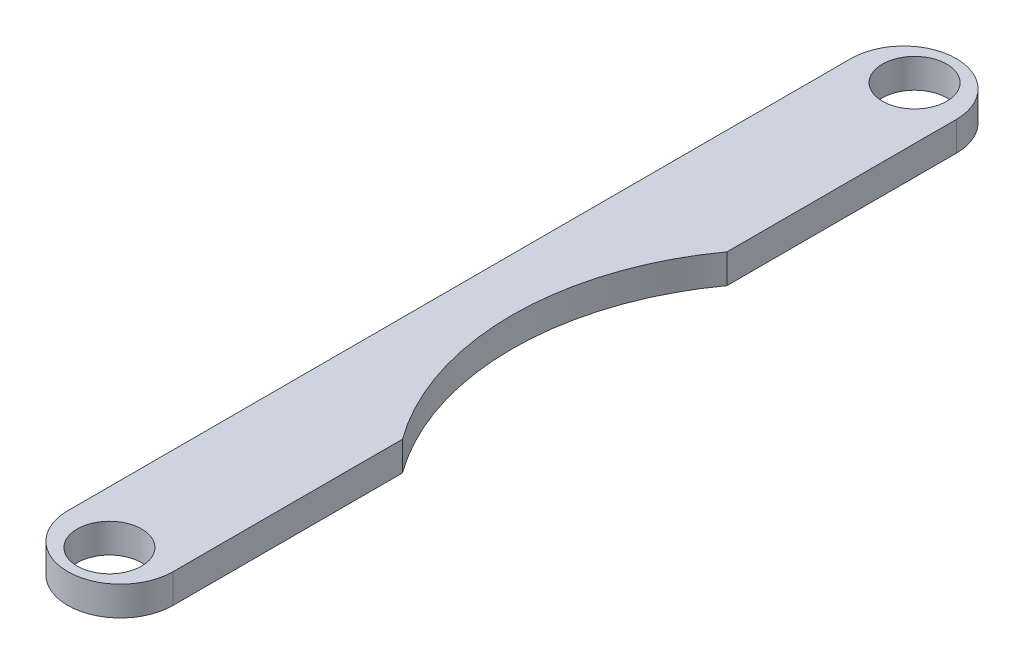
ISO-10303-21;
HEADER;
FILE_DESCRIPTION(('STEP AP214'),'2;1');
FILE_NAME('part.step','',(''),(''),'','','');
FILE_SCHEMA(('AUTOMOTIVE_DESIGN { 1 0 10303 214 1 1 1 1 }'));
ENDSEC;
DATA;
#1=APPLICATION_CONTEXT('core data for automotive mechanical design processes');
#2=APPLICATION_PROTOCOL_DEFINITION('international standard','automotive_design',2000,#1);
#3=PRODUCT_CONTEXT('',#1,'mechanical');
#4=PRODUCT('Part','Part','',(#3));
#5=PRODUCT_RELATED_PRODUCT_CATEGORY('part','',(#4));
#6=PRODUCT_DEFINITION_FORMATION('','',#4);
#7=PRODUCT_DEFINITION_CONTEXT('part definition',#1,'design');
#8=PRODUCT_DEFINITION('design','',#6,#7);
#9=PRODUCT_DEFINITION_SHAPE('','',#8);
#10=(LENGTH_UNIT() NAMED_UNIT(*) SI_UNIT(.MILLI.,.METRE.));
#11=(NAMED_UNIT(*) PLANE_ANGLE_UNIT() SI_UNIT($,.RADIAN.));
#12=(NAMED_UNIT(*) SI_UNIT($,.STERADIAN.) SOLID_ANGLE_UNIT());
#13=UNCERTAINTY_MEASURE_WITH_UNIT(LENGTH_MEASURE(1.E-05),#10,'distance_accuracy_value','');
#14=(GEOMETRIC_REPRESENTATION_CONTEXT(3) GLOBAL_UNCERTAINTY_ASSIGNED_CONTEXT((#13)) GLOBAL_UNIT_ASSIGNED_CONTEXT((#10,
#11,#12)) REPRESENTATION_CONTEXT('',''));
#15=CARTESIAN_POINT('',(0.,0.,0.));
#16=DIRECTION('',(0.,0.,1.));
#17=DIRECTION('',(1.,0.,0.));
#18=AXIS2_PLACEMENT_3D('',#15,#16,#17);
#19=CARTESIAN_POINT('',(1.8,1.,13.375));
#20=DIRECTION('',(-1.,0.,0.));
#21=DIRECTION('',(0.,0.,1.));
#22=AXIS2_PLACEMENT_3D('',#19,#20,#21);
#23=PLANE('',#22);
#24=DIRECTION('',(0.,0.,-1.));
#25=VECTOR('',#24,1.);
#26=CARTESIAN_POINT('',(1.8,1.,13.375));
#27=LINE('',#26,#25);
#28=CARTESIAN_POINT('',(1.8,1.,-5.54156314011208));
#29=VERTEX_POINT('',#28);
#30=CARTESIAN_POINT('',(1.79999999999999,1.,-13.375));
#31=VERTEX_POINT('',#30);
#32=EDGE_CURVE('E114',#29,#31,#27,.T.);
#33=ORIENTED_EDGE('',*,*,#32,.F.);
#34=DIRECTION('',(0.,-1.,0.));
#35=VECTOR('',#34,1.);
#36=CARTESIAN_POINT('',(1.8,1.001,-5.54156314011208));
#37=LINE('',#36,#35);
#38=CARTESIAN_POINT('',(1.8,0.,-5.54156314011209));
#39=VERTEX_POINT('',#38);
#40=EDGE_CURVE('E102',#39,#29,#37,.F.);
#41=ORIENTED_EDGE('',*,*,#40,.F.);
#42=DIRECTION('',(0.,0.,-1.));
#43=VECTOR('',#42,1.);
#44=CARTESIAN_POINT('',(1.8,0.,13.375));
#45=LINE('',#44,#43);
#46=CARTESIAN_POINT('',(1.79999999999999,0.,-13.375));
#47=VERTEX_POINT('',#46);
#48=EDGE_CURVE('E112',#39,#47,#45,.T.);
#49=ORIENTED_EDGE('',*,*,#48,.T.);
#50=DIRECTION('',(0.,-1.,0.));
#51=VECTOR('',#50,1.);
#52=CARTESIAN_POINT('',(1.79999999999999,1.,-13.375));
#53=LINE('',#52,#51);
#54=EDGE_CURVE('E47',#31,#47,#53,.T.);
#55=ORIENTED_EDGE('',*,*,#54,.F.);
#56=EDGE_LOOP('',(#33,#41,#49,#55));
#57=FACE_BOUND('',#56,.T.);
#58=ADVANCED_FACE('F38',(#57),#23,.F.);
#59=CARTESIAN_POINT('',(0.,1.,13.375));
#60=DIRECTION('',(0.,1.,0.));
#61=DIRECTION('',(0.,0.,1.));
#62=AXIS2_PLACEMENT_3D('',#59,#60,#61);
#63=PLANE('',#62);
#64=CARTESIAN_POINT('',(9.43025612106917,1.,0.));
#65=DIRECTION('',(0.,1.,0.));
#66=DIRECTION('',(0.,0.,1.));
#67=AXIS2_PLACEMENT_3D('',#64,#65,#66);
#68=CIRCLE('',#67,9.43025612106917);
#69=CARTESIAN_POINT('',(1.8,1.,5.54156314011209));
#70=VERTEX_POINT('',#69);
#71=EDGE_CURVE('E54',#70,#29,#68,.F.);
#72=ORIENTED_EDGE('',*,*,#71,.T.);
#73=ORIENTED_EDGE('',*,*,#32,.T.);
#74=CARTESIAN_POINT('',(0.,1.,-13.375));
#75=DIRECTION('',(0.,1.,0.));
#76=DIRECTION('',(0.,0.,1.));
#77=AXIS2_PLACEMENT_3D('',#74,#75,#76);
#78=CIRCLE('',#77,1.8);
#79=CARTESIAN_POINT('',(-1.8,1.,-13.375));
#80=VERTEX_POINT('',#79);
#81=EDGE_CURVE('E147',#31,#80,#78,.T.);
#82=ORIENTED_EDGE('',*,*,#81,.T.);
#83=DIRECTION('',(0.,0.,1.));
#84=VECTOR('',#83,1.);
#85=CARTESIAN_POINT('',(-1.8,1.,13.375));
#86=LINE('',#85,#84);
#87=CARTESIAN_POINT('',(-1.8,1.,13.375));
#88=VERTEX_POINT('',#87);
#89=EDGE_CURVE('E63',#80,#88,#86,.T.);
#90=ORIENTED_EDGE('',*,*,#89,.T.);
#91=CARTESIAN_POINT('',(0.,1.,13.375));
#92=DIRECTION('',(0.,1.,0.));
#93=DIRECTION('',(0.,0.,1.));
#94=AXIS2_PLACEMENT_3D('',#91,#92,#93);
#95=CIRCLE('',#94,1.8);
#96=CARTESIAN_POINT('',(1.8,1.,13.375));
#97=VERTEX_POINT('',#96);
#98=EDGE_CURVE('E136',#88,#97,#95,.T.);
#99=ORIENTED_EDGE('',*,*,#98,.T.);
#100=EDGE_CURVE('E90',#97,#70,#27,.T.);
#101=ORIENTED_EDGE('',*,*,#100,.T.);
#102=EDGE_LOOP('',(#72,#73,#82,#90,#99,#101));
#103=FACE_BOUND('',#102,.T.);
#104=CARTESIAN_POINT('',(0.,1.,13.75));
#105=DIRECTION('',(0.,1.,0.));
#106=DIRECTION('',(0.,0.,1.));
#107=AXIS2_PLACEMENT_3D('',#104,#105,#106);
#108=CIRCLE('',#107,1.1);
#109=CARTESIAN_POINT('',(0.,1.,14.85));
#110=VERTEX_POINT('',#109);
#111=EDGE_CURVE('E128',#110,#110,#108,.T.);
#112=ORIENTED_EDGE('',*,*,#111,.F.);
#113=EDGE_LOOP('',(#112));
#114=FACE_BOUND('',#113,.T.);
#115=CARTESIAN_POINT('',(0.,1.,-13.75));
#116=DIRECTION('',(0.,1.,0.));
#117=DIRECTION('',(0.,0.,1.));
#118=AXIS2_PLACEMENT_3D('',#115,#116,#117);
#119=CIRCLE('',#118,1.1);
#120=CARTESIAN_POINT('',(0.,1.,-12.65));
#121=VERTEX_POINT('',#120);
#122=EDGE_CURVE('E160',#121,#121,#119,.T.);
#123=ORIENTED_EDGE('',*,*,#122,.F.);
#124=EDGE_LOOP('',(#123));
#125=FACE_BOUND('',#124,.T.);
#126=ADVANCED_FACE('F174',(#103,#114,#125),#63,.T.);
#127=CARTESIAN_POINT('',(0.,0.,13.375));
#128=DIRECTION('',(0.,1.,0.));
#129=DIRECTION('',(0.,0.,1.));
#130=AXIS2_PLACEMENT_3D('',#127,#128,#129);
#131=PLANE('',#130);
#132=ORIENTED_EDGE('',*,*,#48,.F.);
#133=CARTESIAN_POINT('',(9.43025612106917,0.,0.));
#134=DIRECTION('',(0.,-1.,0.));
#135=DIRECTION('',(0.,0.,-1.));
#136=AXIS2_PLACEMENT_3D('',#133,#134,#135);
#137=CIRCLE('',#136,9.43025612106917);
#138=CARTESIAN_POINT('',(1.79999999998698,0.,5.54156314009364));
#139=VERTEX_POINT('',#138);
#140=EDGE_CURVE('E99',#139,#39,#137,.T.);
#141=ORIENTED_EDGE('',*,*,#140,.F.);
#142=CARTESIAN_POINT('',(1.8,0.,13.375));
#143=VERTEX_POINT('',#142);
#144=EDGE_CURVE('E122',#143,#139,#45,.T.);
#145=ORIENTED_EDGE('',*,*,#144,.F.);
#146=CARTESIAN_POINT('',(0.,0.,13.375));
#147=DIRECTION('',(0.,1.,0.));
#148=DIRECTION('',(0.,0.,1.));
#149=AXIS2_PLACEMENT_3D('',#146,#147,#148);
#150=CIRCLE('',#149,1.8);
#151=CARTESIAN_POINT('',(-1.8,0.,13.375));
#152=VERTEX_POINT('',#151);
#153=EDGE_CURVE('E123',#152,#143,#150,.T.);
#154=ORIENTED_EDGE('',*,*,#153,.F.);
#155=DIRECTION('',(0.,0.,1.));
#156=VECTOR('',#155,1.);
#157=CARTESIAN_POINT('',(-1.8,0.,13.375));
#158=LINE('',#157,#156);
#159=CARTESIAN_POINT('',(-1.8,0.,-13.375));
#160=VERTEX_POINT('',#159);
#161=EDGE_CURVE('E84',#160,#152,#158,.T.);
#162=ORIENTED_EDGE('',*,*,#161,.F.);
#163=CARTESIAN_POINT('',(0.,0.,-13.375));
#164=DIRECTION('',(0.,1.,0.));
#165=DIRECTION('',(0.,0.,1.));
#166=AXIS2_PLACEMENT_3D('',#163,#164,#165);
#167=CIRCLE('',#166,1.8);
#168=EDGE_CURVE('E120',#47,#160,#167,.T.);
#169=ORIENTED_EDGE('',*,*,#168,.F.);
#170=EDGE_LOOP('',(#132,#141,#145,#154,#162,#169));
#171=FACE_BOUND('',#170,.T.);
#172=CARTESIAN_POINT('',(0.,0.,13.75));
#173=DIRECTION('',(0.,1.,0.));
#174=DIRECTION('',(0.,0.,1.));
#175=AXIS2_PLACEMENT_3D('',#172,#173,#174);
#176=CIRCLE('',#175,1.1);
#177=CARTESIAN_POINT('',(0.,0.,14.85));
#178=VERTEX_POINT('',#177);
#179=EDGE_CURVE('E156',#178,#178,#176,.T.);
#180=ORIENTED_EDGE('',*,*,#179,.T.);
#181=EDGE_LOOP('',(#180));
#182=FACE_BOUND('',#181,.T.);
#183=CARTESIAN_POINT('',(0.,0.,-13.75));
#184=DIRECTION('',(0.,1.,0.));
#185=DIRECTION('',(0.,0.,1.));
#186=AXIS2_PLACEMENT_3D('',#183,#184,#185);
#187=CIRCLE('',#186,1.1);
#188=CARTESIAN_POINT('',(0.,0.,-12.65));
#189=VERTEX_POINT('',#188);
#190=EDGE_CURVE('E164',#189,#189,#187,.T.);
#191=ORIENTED_EDGE('',*,*,#190,.T.);
#192=EDGE_LOOP('',(#191));
#193=FACE_BOUND('',#192,.T.);
#194=ADVANCED_FACE('F118',(#171,#182,#193),#131,.F.);
#195=CARTESIAN_POINT('',(0.,1.,13.375));
#196=DIRECTION('',(0.,-1.,0.));
#197=DIRECTION('',(0.,0.,-1.));
#198=AXIS2_PLACEMENT_3D('',#195,#196,#197);
#199=CYLINDRICAL_SURFACE('',#198,1.8);
#200=ORIENTED_EDGE('',*,*,#153,.T.);
#201=DIRECTION('',(0.,-1.,0.));
#202=VECTOR('',#201,1.);
#203=CARTESIAN_POINT('',(1.8,1.,13.375));
#204=LINE('',#203,#202);
#205=EDGE_CURVE('E11',#97,#143,#204,.T.);
#206=ORIENTED_EDGE('',*,*,#205,.F.);
#207=ORIENTED_EDGE('',*,*,#98,.F.);
#208=DIRECTION('',(0.,-1.,0.));
#209=VECTOR('',#208,1.);
#210=CARTESIAN_POINT('',(-1.8,1.,13.375));
#211=LINE('',#210,#209);
#212=EDGE_CURVE('E137',#88,#152,#211,.T.);
#213=ORIENTED_EDGE('',*,*,#212,.T.);
#214=EDGE_LOOP('',(#200,#206,#207,#213));
#215=FACE_BOUND('',#214,.T.);
#216=ADVANCED_FACE('F40',(#215),#199,.T.);
#217=ORIENTED_EDGE('',*,*,#144,.T.);
#218=DIRECTION('',(0.,-1.,0.));
#219=VECTOR('',#218,1.);
#220=CARTESIAN_POINT('',(1.8,1.001,5.54156314011209));
#221=LINE('',#220,#219);
#222=EDGE_CURVE('E103',#70,#139,#221,.T.);
#223=ORIENTED_EDGE('',*,*,#222,.F.);
#224=ORIENTED_EDGE('',*,*,#100,.F.);
#225=ORIENTED_EDGE('',*,*,#205,.T.);
#226=EDGE_LOOP('',(#217,#223,#224,#225));
#227=FACE_BOUND('',#226,.T.);
#228=ADVANCED_FACE('F180',(#227),#23,.F.);
#229=CARTESIAN_POINT('',(0.,1.,-13.375));
#230=DIRECTION('',(0.,-1.,0.));
#231=DIRECTION('',(0.,0.,-1.));
#232=AXIS2_PLACEMENT_3D('',#229,#230,#231);
#233=CYLINDRICAL_SURFACE('',#232,1.8);
#234=ORIENTED_EDGE('',*,*,#168,.T.);
#235=DIRECTION('',(0.,-1.,0.));
#236=VECTOR('',#235,1.);
#237=CARTESIAN_POINT('',(-1.8,1.,-13.375));
#238=LINE('',#237,#236);
#239=EDGE_CURVE('E140',#80,#160,#238,.T.);
#240=ORIENTED_EDGE('',*,*,#239,.F.);
#241=ORIENTED_EDGE('',*,*,#81,.F.);
#242=ORIENTED_EDGE('',*,*,#54,.T.);
#243=EDGE_LOOP('',(#234,#240,#241,#242));
#244=FACE_BOUND('',#243,.T.);
#245=ADVANCED_FACE('F145',(#244),#233,.T.);
#246=CARTESIAN_POINT('',(-1.8,1.,13.375));
#247=DIRECTION('',(1.,0.,0.));
#248=DIRECTION('',(0.,0.,-1.));
#249=AXIS2_PLACEMENT_3D('',#246,#247,#248);
#250=PLANE('',#249);
#251=ORIENTED_EDGE('',*,*,#161,.T.);
#252=ORIENTED_EDGE('',*,*,#212,.F.);
#253=ORIENTED_EDGE('',*,*,#89,.F.);
#254=ORIENTED_EDGE('',*,*,#239,.T.);
#255=EDGE_LOOP('',(#251,#252,#253,#254));
#256=FACE_BOUND('',#255,.T.);
#257=ADVANCED_FACE('F186',(#256),#250,.F.);
#258=CARTESIAN_POINT('',(0.,1.,13.75));
#259=DIRECTION('',(0.,-1.,0.));
#260=DIRECTION('',(0.,0.,-1.));
#261=AXIS2_PLACEMENT_3D('',#258,#259,#260);
#262=CYLINDRICAL_SURFACE('',#261,1.1);
#263=ORIENTED_EDGE('',*,*,#111,.T.);
#264=EDGE_LOOP('',(#263));
#265=FACE_BOUND('',#264,.T.);
#266=ORIENTED_EDGE('',*,*,#179,.F.);
#267=EDGE_LOOP('',(#266));
#268=FACE_BOUND('',#267,.T.);
#269=ADVANCED_FACE('F198',(#265,#268),#262,.F.);
#270=CARTESIAN_POINT('',(0.,1.,-13.75));
#271=DIRECTION('',(0.,-1.,0.));
#272=DIRECTION('',(0.,0.,-1.));
#273=AXIS2_PLACEMENT_3D('',#270,#271,#272);
#274=CYLINDRICAL_SURFACE('',#273,1.1);
#275=ORIENTED_EDGE('',*,*,#122,.T.);
#276=EDGE_LOOP('',(#275));
#277=FACE_BOUND('',#276,.T.);
#278=ORIENTED_EDGE('',*,*,#190,.F.);
#279=EDGE_LOOP('',(#278));
#280=FACE_BOUND('',#279,.T.);
#281=ADVANCED_FACE('F205',(#277,#280),#274,.F.);
#282=CARTESIAN_POINT('',(9.43025612106917,1.001,0.));
#283=DIRECTION('',(0.,-1.,0.));
#284=DIRECTION('',(0.,0.,-1.));
#285=AXIS2_PLACEMENT_3D('',#282,#283,#284);
#286=CYLINDRICAL_SURFACE('',#285,9.43025612106917);
#287=ORIENTED_EDGE('',*,*,#40,.T.);
#288=ORIENTED_EDGE('',*,*,#71,.F.);
#289=ORIENTED_EDGE('',*,*,#222,.T.);
#290=ORIENTED_EDGE('',*,*,#140,.T.);
#291=EDGE_LOOP('',(#287,#288,#289,#290));
#292=FACE_BOUND('',#291,.T.);
#293=ADVANCED_FACE('F101',(#292),#286,.F.);
#294=CLOSED_SHELL('',(#58,#126,#194,#216,#228,#245,#257,#269,#281,#293));
#295=MANIFOLD_SOLID_BREP('B2',#294);
#296=ADVANCED_BREP_SHAPE_REPRESENTATION('',(#18,#295),#14);
#297=SHAPE_DEFINITION_REPRESENTATION(#9,#296);
ENDSEC;
END-ISO-10303-21;
